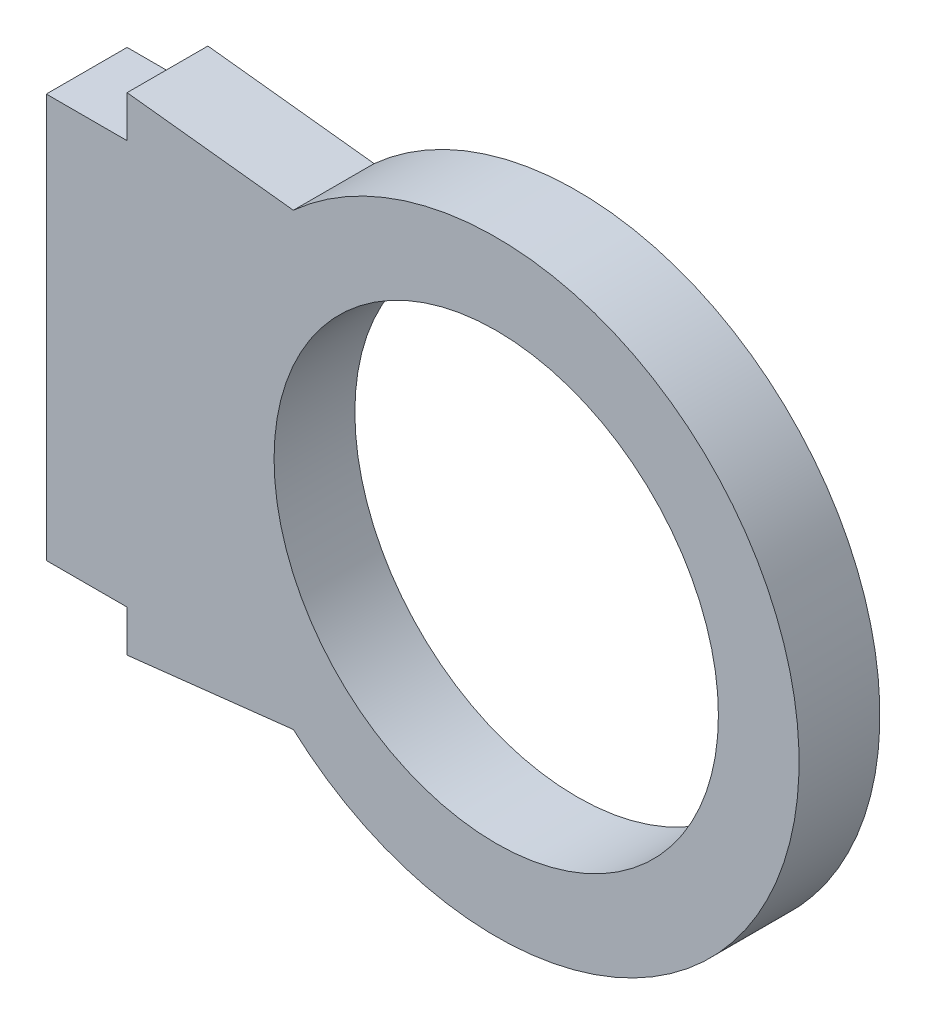
ISO-10303-21;
HEADER;
FILE_DESCRIPTION(('STEP AP214'),'2;1');
FILE_NAME('part.step','',(''),(''),'','','');
FILE_SCHEMA(('AUTOMOTIVE_DESIGN { 1 0 10303 214 1 1 1 1 }'));
ENDSEC;
DATA;
#1=APPLICATION_CONTEXT('core data for automotive mechanical design processes');
#2=APPLICATION_PROTOCOL_DEFINITION('international standard','automotive_design',2000,#1);
#3=PRODUCT_CONTEXT('',#1,'mechanical');
#4=PRODUCT('Part','Part','',(#3));
#5=PRODUCT_RELATED_PRODUCT_CATEGORY('part','',(#4));
#6=PRODUCT_DEFINITION_FORMATION('','',#4);
#7=PRODUCT_DEFINITION_CONTEXT('part definition',#1,'design');
#8=PRODUCT_DEFINITION('design','',#6,#7);
#9=PRODUCT_DEFINITION_SHAPE('','',#8);
#10=(LENGTH_UNIT() NAMED_UNIT(*) SI_UNIT(.MILLI.,.METRE.));
#11=(NAMED_UNIT(*) PLANE_ANGLE_UNIT() SI_UNIT($,.RADIAN.));
#12=(NAMED_UNIT(*) SI_UNIT($,.STERADIAN.) SOLID_ANGLE_UNIT());
#13=UNCERTAINTY_MEASURE_WITH_UNIT(LENGTH_MEASURE(1.E-05),#10,'distance_accuracy_value','');
#14=(GEOMETRIC_REPRESENTATION_CONTEXT(3) GLOBAL_UNCERTAINTY_ASSIGNED_CONTEXT((#13)) GLOBAL_UNIT_ASSIGNED_CONTEXT((#10,
#11,#12)) REPRESENTATION_CONTEXT('',''));
#15=CARTESIAN_POINT('',(0.,0.,0.));
#16=DIRECTION('',(0.,0.,1.));
#17=DIRECTION('',(1.,0.,0.));
#18=AXIS2_PLACEMENT_3D('',#15,#16,#17);
#19=CARTESIAN_POINT('',(0.878927207423718,-7.8073920540141,4.));
#20=DIRECTION('',(-0.111869633286238,0.993722891528822,0.));
#21=DIRECTION('',(-0.993722891528822,-0.111869633286239,0.));
#22=AXIS2_PLACEMENT_3D('',#19,#20,#21);
#23=PLANE('',#22);
#24=DIRECTION('',(0.993722891528822,0.111869633286238,0.));
#25=VECTOR('',#24,1.);
#26=CARTESIAN_POINT('',(0.878927207423718,-7.8073920540141,0.));
#27=LINE('',#26,#25);
#28=CARTESIAN_POINT('',(2.,-7.68118584173721,0.));
#29=VERTEX_POINT('',#28);
#30=CARTESIAN_POINT('',(10.2308533400937,-6.75458693510189,0.));
#31=VERTEX_POINT('',#30);
#32=EDGE_CURVE('E56',#29,#31,#27,.T.);
#33=ORIENTED_EDGE('',*,*,#32,.T.);
#34=DIRECTION('',(0.,0.,1.));
#35=VECTOR('',#34,1.);
#36=CARTESIAN_POINT('',(10.2308533400937,-6.75458693510189,0.));
#37=LINE('',#36,#35);
#38=CARTESIAN_POINT('',(10.2308533400937,-6.75458693510189,4.));
#39=VERTEX_POINT('',#38);
#40=EDGE_CURVE('E51',#31,#39,#37,.T.);
#41=ORIENTED_EDGE('',*,*,#40,.T.);
#42=DIRECTION('',(0.993722891528822,0.111869633286238,0.));
#43=VECTOR('',#42,1.);
#44=CARTESIAN_POINT('',(0.878927207423718,-7.8073920540141,4.));
#45=LINE('',#44,#43);
#46=CARTESIAN_POINT('',(2.,-7.68118584173721,4.));
#47=VERTEX_POINT('',#46);
#48=EDGE_CURVE('E137',#47,#39,#45,.T.);
#49=ORIENTED_EDGE('',*,*,#48,.F.);
#50=DIRECTION('',(0.,0.,-1.));
#51=VECTOR('',#50,1.);
#52=CARTESIAN_POINT('',(2.,-7.68118584173721,4.));
#53=LINE('',#52,#51);
#54=EDGE_CURVE('E138',#47,#29,#53,.T.);
#55=ORIENTED_EDGE('',*,*,#54,.T.);
#56=EDGE_LOOP('',(#33,#41,#49,#55));
#57=FACE_BOUND('',#56,.T.);
#58=ADVANCED_FACE('F37',(#57),#23,.F.);
#59=CARTESIAN_POINT('',(1.85232898374949,16.4539889845211,4.));
#60=DIRECTION('',(0.111869633286238,0.993722891528822,0.));
#61=DIRECTION('',(-0.993722891528822,0.111869633286239,0.));
#62=AXIS2_PLACEMENT_3D('',#59,#60,#61);
#63=PLANE('',#62);
#64=DIRECTION('',(0.,0.,1.));
#65=VECTOR('',#64,1.);
#66=CARTESIAN_POINT('',(10.2308533400937,15.5107658232009,0.));
#67=LINE('',#66,#65);
#68=CARTESIAN_POINT('',(10.2308533400937,15.5107658232009,0.));
#69=VERTEX_POINT('',#68);
#70=CARTESIAN_POINT('',(10.2308533400937,15.5107658232009,4.));
#71=VERTEX_POINT('',#70);
#72=EDGE_CURVE('E102',#69,#71,#67,.T.);
#73=ORIENTED_EDGE('',*,*,#72,.F.);
#74=DIRECTION('',(0.993722891528822,-0.111869633286238,0.));
#75=VECTOR('',#74,1.);
#76=CARTESIAN_POINT('',(1.85232898374949,16.4539889845211,0.));
#77=LINE('',#76,#75);
#78=CARTESIAN_POINT('',(2.,16.4373647298362,0.));
#79=VERTEX_POINT('',#78);
#80=EDGE_CURVE('E113',#79,#69,#77,.T.);
#81=ORIENTED_EDGE('',*,*,#80,.F.);
#82=DIRECTION('',(0.,0.,-1.));
#83=VECTOR('',#82,1.);
#84=CARTESIAN_POINT('',(2.,16.4373647298362,4.));
#85=LINE('',#84,#83);
#86=CARTESIAN_POINT('',(2.,16.4373647298362,4.));
#87=VERTEX_POINT('',#86);
#88=EDGE_CURVE('E11',#87,#79,#85,.T.);
#89=ORIENTED_EDGE('',*,*,#88,.F.);
#90=DIRECTION('',(0.993722891528822,-0.111869633286238,0.));
#91=VECTOR('',#90,1.);
#92=CARTESIAN_POINT('',(1.85232898374949,16.4539889845211,4.));
#93=LINE('',#92,#91);
#94=EDGE_CURVE('E116',#87,#71,#93,.T.);
#95=ORIENTED_EDGE('',*,*,#94,.T.);
#96=EDGE_LOOP('',(#73,#81,#89,#95));
#97=FACE_BOUND('',#96,.T.);
#98=ADVANCED_FACE('F112',(#97),#63,.T.);
#99=CARTESIAN_POINT('',(2.,0.,4.));
#100=DIRECTION('',(-1.,0.,0.));
#101=DIRECTION('',(0.,0.,1.));
#102=AXIS2_PLACEMENT_3D('',#99,#100,#101);
#103=PLANE('',#102);
#104=DIRECTION('',(0.,1.,0.));
#105=VECTOR('',#104,1.);
#106=CARTESIAN_POINT('',(2.,0.,0.));
#107=LINE('',#106,#105);
#108=CARTESIAN_POINT('',(2.,14.3780894440495,0.));
#109=VERTEX_POINT('',#108);
#110=EDGE_CURVE('E121',#109,#79,#107,.T.);
#111=ORIENTED_EDGE('',*,*,#110,.F.);
#112=DIRECTION('',(0.,0.,-1.));
#113=VECTOR('',#112,1.);
#114=CARTESIAN_POINT('',(2.,14.3780894440495,4.));
#115=LINE('',#114,#113);
#116=CARTESIAN_POINT('',(2.,14.3780894440495,4.));
#117=VERTEX_POINT('',#116);
#118=EDGE_CURVE('E44',#117,#109,#115,.T.);
#119=ORIENTED_EDGE('',*,*,#118,.F.);
#120=DIRECTION('',(0.,1.,0.));
#121=VECTOR('',#120,1.);
#122=CARTESIAN_POINT('',(2.,0.,4.));
#123=LINE('',#122,#121);
#124=EDGE_CURVE('E159',#117,#87,#123,.T.);
#125=ORIENTED_EDGE('',*,*,#124,.T.);
#126=ORIENTED_EDGE('',*,*,#88,.T.);
#127=EDGE_LOOP('',(#111,#119,#125,#126));
#128=FACE_BOUND('',#127,.T.);
#129=ADVANCED_FACE('F158',(#128),#103,.T.);
#130=CARTESIAN_POINT('',(0.,14.3780894440495,4.));
#131=DIRECTION('',(0.,-1.,0.));
#132=DIRECTION('',(0.,0.,-1.));
#133=AXIS2_PLACEMENT_3D('',#130,#131,#132);
#134=PLANE('',#133);
#135=DIRECTION('',(-1.,0.,0.));
#136=VECTOR('',#135,1.);
#137=CARTESIAN_POINT('',(0.,14.3780894440495,0.));
#138=LINE('',#137,#136);
#139=CARTESIAN_POINT('',(-2.,14.3780894440495,0.));
#140=VERTEX_POINT('',#139);
#141=EDGE_CURVE('E123',#109,#140,#138,.T.);
#142=ORIENTED_EDGE('',*,*,#141,.T.);
#143=DIRECTION('',(0.,0.,-1.));
#144=VECTOR('',#143,1.);
#145=CARTESIAN_POINT('',(-2.,14.3780894440495,4.));
#146=LINE('',#145,#144);
#147=CARTESIAN_POINT('',(-2.,14.3780894440495,4.));
#148=VERTEX_POINT('',#147);
#149=EDGE_CURVE('E146',#148,#140,#146,.T.);
#150=ORIENTED_EDGE('',*,*,#149,.F.);
#151=DIRECTION('',(-1.,0.,0.));
#152=VECTOR('',#151,1.);
#153=CARTESIAN_POINT('',(0.,14.3780894440495,4.));
#154=LINE('',#153,#152);
#155=EDGE_CURVE('E152',#117,#148,#154,.T.);
#156=ORIENTED_EDGE('',*,*,#155,.F.);
#157=ORIENTED_EDGE('',*,*,#118,.T.);
#158=EDGE_LOOP('',(#142,#150,#156,#157));
#159=FACE_BOUND('',#158,.T.);
#160=ADVANCED_FACE('F150',(#159),#134,.F.);
#161=CARTESIAN_POINT('',(-2.,0.,4.));
#162=DIRECTION('',(1.,0.,0.));
#163=DIRECTION('',(0.,0.,-1.));
#164=AXIS2_PLACEMENT_3D('',#161,#162,#163);
#165=PLANE('',#164);
#166=DIRECTION('',(0.,-1.,0.));
#167=VECTOR('',#166,1.);
#168=CARTESIAN_POINT('',(-2.,0.,0.));
#169=LINE('',#168,#167);
#170=CARTESIAN_POINT('',(-2.,-5.62191055595049,0.));
#171=VERTEX_POINT('',#170);
#172=EDGE_CURVE('E129',#140,#171,#169,.T.);
#173=ORIENTED_EDGE('',*,*,#172,.T.);
#174=DIRECTION('',(0.,0.,-1.));
#175=VECTOR('',#174,1.);
#176=CARTESIAN_POINT('',(-2.,-5.62191055595049,4.));
#177=LINE('',#176,#175);
#178=CARTESIAN_POINT('',(-2.,-5.62191055595049,4.));
#179=VERTEX_POINT('',#178);
#180=EDGE_CURVE('E143',#179,#171,#177,.T.);
#181=ORIENTED_EDGE('',*,*,#180,.F.);
#182=DIRECTION('',(0.,-1.,0.));
#183=VECTOR('',#182,1.);
#184=CARTESIAN_POINT('',(-2.,0.,4.));
#185=LINE('',#184,#183);
#186=EDGE_CURVE('E169',#148,#179,#185,.T.);
#187=ORIENTED_EDGE('',*,*,#186,.F.);
#188=ORIENTED_EDGE('',*,*,#149,.T.);
#189=EDGE_LOOP('',(#173,#181,#187,#188));
#190=FACE_BOUND('',#189,.T.);
#191=ADVANCED_FACE('F184',(#190),#165,.F.);
#192=CARTESIAN_POINT('',(0.,-5.62191055595049,4.));
#193=DIRECTION('',(0.,1.,0.));
#194=DIRECTION('',(0.,0.,1.));
#195=AXIS2_PLACEMENT_3D('',#192,#193,#194);
#196=PLANE('',#195);
#197=DIRECTION('',(1.,0.,0.));
#198=VECTOR('',#197,1.);
#199=CARTESIAN_POINT('',(0.,-5.62191055595049,0.));
#200=LINE('',#199,#198);
#201=CARTESIAN_POINT('',(2.,-5.62191055595049,0.));
#202=VERTEX_POINT('',#201);
#203=EDGE_CURVE('E131',#171,#202,#200,.T.);
#204=ORIENTED_EDGE('',*,*,#203,.T.);
#205=DIRECTION('',(0.,0.,-1.));
#206=VECTOR('',#205,1.);
#207=CARTESIAN_POINT('',(2.,-5.62191055595049,4.));
#208=LINE('',#207,#206);
#209=CARTESIAN_POINT('',(2.,-5.62191055595049,4.));
#210=VERTEX_POINT('',#209);
#211=EDGE_CURVE('E140',#210,#202,#208,.T.);
#212=ORIENTED_EDGE('',*,*,#211,.F.);
#213=DIRECTION('',(1.,0.,0.));
#214=VECTOR('',#213,1.);
#215=CARTESIAN_POINT('',(0.,-5.62191055595049,4.));
#216=LINE('',#215,#214);
#217=EDGE_CURVE('E171',#179,#210,#216,.T.);
#218=ORIENTED_EDGE('',*,*,#217,.F.);
#219=ORIENTED_EDGE('',*,*,#180,.T.);
#220=EDGE_LOOP('',(#204,#212,#218,#219));
#221=FACE_BOUND('',#220,.T.);
#222=ADVANCED_FACE('F182',(#221),#196,.F.);
#223=CARTESIAN_POINT('',(2.,0.,4.));
#224=DIRECTION('',(-1.,0.,0.));
#225=DIRECTION('',(0.,0.,1.));
#226=AXIS2_PLACEMENT_3D('',#223,#224,#225);
#227=PLANE('',#226);
#228=DIRECTION('',(0.,1.,0.));
#229=VECTOR('',#228,1.);
#230=CARTESIAN_POINT('',(2.,0.,0.));
#231=LINE('',#230,#229);
#232=EDGE_CURVE('E134',#29,#202,#231,.T.);
#233=ORIENTED_EDGE('',*,*,#232,.F.);
#234=ORIENTED_EDGE('',*,*,#54,.F.);
#235=DIRECTION('',(0.,1.,0.));
#236=VECTOR('',#235,1.);
#237=CARTESIAN_POINT('',(2.,0.,4.));
#238=LINE('',#237,#236);
#239=EDGE_CURVE('E141',#47,#210,#238,.T.);
#240=ORIENTED_EDGE('',*,*,#239,.T.);
#241=ORIENTED_EDGE('',*,*,#211,.T.);
#242=EDGE_LOOP('',(#233,#234,#240,#241));
#243=FACE_BOUND('',#242,.T.);
#244=ADVANCED_FACE('F176',(#243),#227,.T.);
#245=CARTESIAN_POINT('',(0.,0.,4.));
#246=DIRECTION('',(0.,0.,1.));
#247=DIRECTION('',(1.,0.,0.));
#248=AXIS2_PLACEMENT_3D('',#245,#246,#247);
#249=PLANE('',#248);
#250=CARTESIAN_POINT('',(20.2761325622203,4.37808944404951,4.));
#251=DIRECTION('',(0.,0.,1.));
#252=DIRECTION('',(1.,0.,0.));
#253=AXIS2_PLACEMENT_3D('',#250,#251,#252);
#254=CIRCLE('',#253,11.);
#255=CARTESIAN_POINT('',(31.2761325622203,4.37808944404951,4.));
#256=VERTEX_POINT('',#255);
#257=EDGE_CURVE('E107',#256,#256,#254,.T.);
#258=ORIENTED_EDGE('',*,*,#257,.F.);
#259=EDGE_LOOP('',(#258));
#260=FACE_BOUND('',#259,.T.);
#261=ORIENTED_EDGE('',*,*,#48,.T.);
#262=CARTESIAN_POINT('',(20.2761325622203,4.37808944404951,4.));
#263=DIRECTION('',(0.,0.,1.));
#264=DIRECTION('',(1.,0.,0.));
#265=AXIS2_PLACEMENT_3D('',#262,#263,#264);
#266=CIRCLE('',#265,14.9948030334981);
#267=EDGE_CURVE('E162',#39,#71,#266,.T.);
#268=ORIENTED_EDGE('',*,*,#267,.T.);
#269=ORIENTED_EDGE('',*,*,#94,.F.);
#270=ORIENTED_EDGE('',*,*,#124,.F.);
#271=ORIENTED_EDGE('',*,*,#155,.T.);
#272=ORIENTED_EDGE('',*,*,#186,.T.);
#273=ORIENTED_EDGE('',*,*,#217,.T.);
#274=ORIENTED_EDGE('',*,*,#239,.F.);
#275=EDGE_LOOP('',(#261,#268,#269,#270,#271,#272,#273,#274));
#276=FACE_BOUND('',#275,.T.);
#277=ADVANCED_FACE('F161',(#260,#276),#249,.T.);
#278=CARTESIAN_POINT('',(0.,0.,0.));
#279=DIRECTION('',(0.,0.,1.));
#280=DIRECTION('',(1.,0.,0.));
#281=AXIS2_PLACEMENT_3D('',#278,#279,#280);
#282=PLANE('',#281);
#283=CARTESIAN_POINT('',(20.2761325622203,4.37808944404951,0.));
#284=DIRECTION('',(0.,0.,1.));
#285=DIRECTION('',(1.,0.,0.));
#286=AXIS2_PLACEMENT_3D('',#283,#284,#285);
#287=CIRCLE('',#286,11.);
#288=CARTESIAN_POINT('',(31.2761325622203,4.37808944404951,0.));
#289=VERTEX_POINT('',#288);
#290=EDGE_CURVE('E106',#289,#289,#287,.T.);
#291=ORIENTED_EDGE('',*,*,#290,.T.);
#292=EDGE_LOOP('',(#291));
#293=FACE_BOUND('',#292,.T.);
#294=ORIENTED_EDGE('',*,*,#32,.F.);
#295=ORIENTED_EDGE('',*,*,#232,.T.);
#296=ORIENTED_EDGE('',*,*,#203,.F.);
#297=ORIENTED_EDGE('',*,*,#172,.F.);
#298=ORIENTED_EDGE('',*,*,#141,.F.);
#299=ORIENTED_EDGE('',*,*,#110,.T.);
#300=ORIENTED_EDGE('',*,*,#80,.T.);
#301=CARTESIAN_POINT('',(20.2761325622203,4.37808944404951,0.));
#302=DIRECTION('',(0.,0.,1.));
#303=DIRECTION('',(1.,0.,0.));
#304=AXIS2_PLACEMENT_3D('',#301,#302,#303);
#305=CIRCLE('',#304,14.9948030334981);
#306=EDGE_CURVE('E98',#31,#69,#305,.T.);
#307=ORIENTED_EDGE('',*,*,#306,.F.);
#308=EDGE_LOOP('',(#294,#295,#296,#297,#298,#299,#300,#307));
#309=FACE_BOUND('',#308,.T.);
#310=ADVANCED_FACE('F118',(#293,#309),#282,.F.);
#311=CARTESIAN_POINT('',(20.2761325622203,4.37808944404951,0.));
#312=DIRECTION('',(0.,0.,1.));
#313=DIRECTION('',(1.,0.,0.));
#314=AXIS2_PLACEMENT_3D('',#311,#312,#313);
#315=CYLINDRICAL_SURFACE('',#314,11.);
#316=ORIENTED_EDGE('',*,*,#257,.T.);
#317=EDGE_LOOP('',(#316));
#318=FACE_BOUND('',#317,.T.);
#319=ORIENTED_EDGE('',*,*,#290,.F.);
#320=EDGE_LOOP('',(#319));
#321=FACE_BOUND('',#320,.T.);
#322=ADVANCED_FACE('F245',(#318,#321),#315,.F.);
#323=CARTESIAN_POINT('',(20.2761325622203,4.37808944404951,0.));
#324=DIRECTION('',(0.,0.,1.));
#325=DIRECTION('',(1.,0.,0.));
#326=AXIS2_PLACEMENT_3D('',#323,#324,#325);
#327=CYLINDRICAL_SURFACE('',#326,14.9948030334981);
#328=ORIENTED_EDGE('',*,*,#267,.F.);
#329=ORIENTED_EDGE('',*,*,#40,.F.);
#330=ORIENTED_EDGE('',*,*,#306,.T.);
#331=ORIENTED_EDGE('',*,*,#72,.T.);
#332=EDGE_LOOP('',(#328,#329,#330,#331));
#333=FACE_BOUND('',#332,.T.);
#334=ADVANCED_FACE('F101',(#333),#327,.T.);
#335=CLOSED_SHELL('',(#58,#98,#129,#160,#191,#222,#244,#277,#310,#322,#334));
#336=MANIFOLD_SOLID_BREP('B2',#335);
#337=ADVANCED_BREP_SHAPE_REPRESENTATION('',(#18,#336),#14);
#338=SHAPE_DEFINITION_REPRESENTATION(#9,#337);
ENDSEC;
END-ISO-10303-21;
